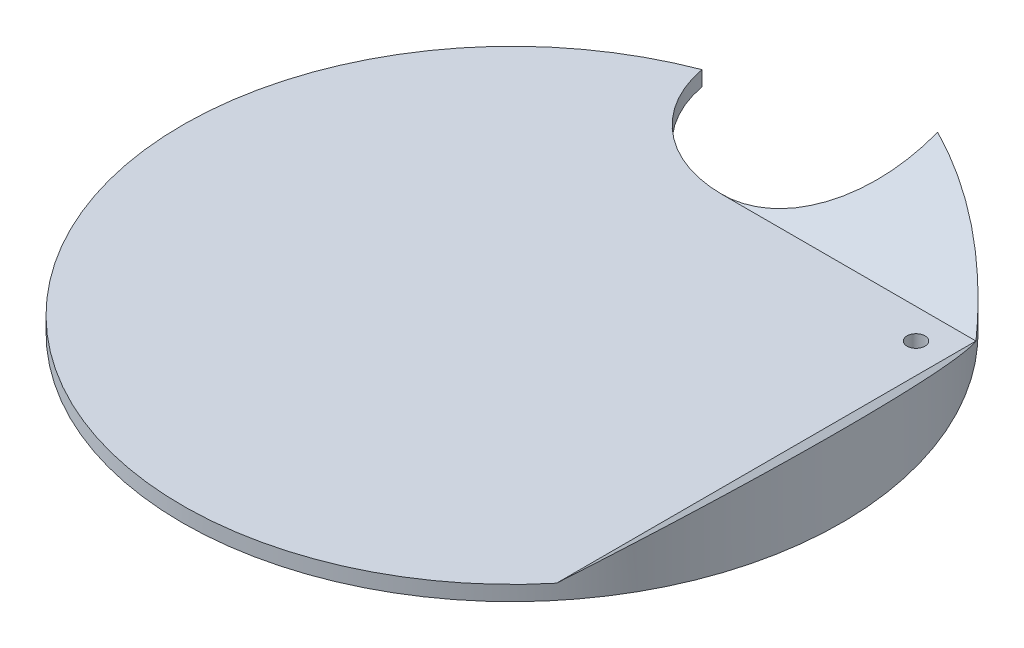
ISO-10303-21;
HEADER;
FILE_DESCRIPTION(('STEP AP214'),'2;1');
FILE_NAME('part.step','',(''),(''),'','','');
FILE_SCHEMA(('AUTOMOTIVE_DESIGN { 1 0 10303 214 1 1 1 1 }'));
ENDSEC;
DATA;
#1=APPLICATION_CONTEXT('core data for automotive mechanical design processes');
#2=APPLICATION_PROTOCOL_DEFINITION('international standard','automotive_design',2000,#1);
#3=PRODUCT_CONTEXT('',#1,'mechanical');
#4=PRODUCT('Part','Part','',(#3));
#5=PRODUCT_RELATED_PRODUCT_CATEGORY('part','',(#4));
#6=PRODUCT_DEFINITION_FORMATION('','',#4);
#7=PRODUCT_DEFINITION_CONTEXT('part definition',#1,'design');
#8=PRODUCT_DEFINITION('design','',#6,#7);
#9=PRODUCT_DEFINITION_SHAPE('','',#8);
#10=(LENGTH_UNIT() NAMED_UNIT(*) SI_UNIT(.MILLI.,.METRE.));
#11=(NAMED_UNIT(*) PLANE_ANGLE_UNIT() SI_UNIT($,.RADIAN.));
#12=(NAMED_UNIT(*) SI_UNIT($,.STERADIAN.) SOLID_ANGLE_UNIT());
#13=UNCERTAINTY_MEASURE_WITH_UNIT(LENGTH_MEASURE(1.E-05),#10,'distance_accuracy_value','');
#14=(GEOMETRIC_REPRESENTATION_CONTEXT(3) GLOBAL_UNCERTAINTY_ASSIGNED_CONTEXT((#13)) GLOBAL_UNIT_ASSIGNED_CONTEXT((#10,
#11,#12)) REPRESENTATION_CONTEXT('',''));
#15=CARTESIAN_POINT('',(0.,0.,0.));
#16=DIRECTION('',(0.,0.,1.));
#17=DIRECTION('',(1.,0.,0.));
#18=AXIS2_PLACEMENT_3D('',#15,#16,#17);
#19=CARTESIAN_POINT('',(0.,12.7,0.));
#20=DIRECTION('',(0.,1.,0.));
#21=DIRECTION('',(0.,0.,1.));
#22=AXIS2_PLACEMENT_3D('',#19,#20,#21);
#23=PLANE('',#22);
#24=CARTESIAN_POINT('',(190.12614690566,12.7,-152.4));
#25=DIRECTION('',(0.,1.,0.));
#26=DIRECTION('',(0.,0.,1.));
#27=AXIS2_PLACEMENT_3D('',#24,#25,#26);
#28=CIRCLE('',#27,7.62);
#29=CARTESIAN_POINT('',(190.12614690566,12.7,-144.78));
#30=VERTEX_POINT('',#29);
#31=EDGE_CURVE('E153',#30,#30,#28,.T.);
#32=ORIENTED_EDGE('',*,*,#31,.F.);
#33=EDGE_LOOP('',(#32));
#34=FACE_BOUND('',#33,.T.);
#35=DIRECTION('',(0.,0.,1.));
#36=VECTOR('',#35,1.);
#37=CARTESIAN_POINT('',(215.52614690566,12.7,0.));
#38=LINE('',#37,#36);
#39=CARTESIAN_POINT('',(215.52614690566,12.7,-177.8));
#40=VERTEX_POINT('',#39);
#41=CARTESIAN_POINT('',(215.52614690566,12.7,177.8));
#42=VERTEX_POINT('',#41);
#43=EDGE_CURVE('E105',#40,#42,#38,.T.);
#44=ORIENTED_EDGE('',*,*,#43,.F.);
#45=DIRECTION('',(1.,0.,0.));
#46=VECTOR('',#45,1.);
#47=CARTESIAN_POINT('',(0.,12.7,-177.8));
#48=LINE('',#47,#46);
#49=CARTESIAN_POINT('',(0.,12.7,-177.8));
#50=VERTEX_POINT('',#49);
#51=EDGE_CURVE('E95',#50,#40,#48,.T.);
#52=ORIENTED_EDGE('',*,*,#51,.F.);
#53=CARTESIAN_POINT('',(0.,12.7,-279.4));
#54=DIRECTION('',(0.,1.,0.));
#55=DIRECTION('',(0.,0.,1.));
#56=AXIS2_PLACEMENT_3D('',#53,#54,#55);
#57=CIRCLE('',#56,101.6);
#58=CARTESIAN_POINT('',(-99.9065480692203,12.7,-260.927272727273));
#59=VERTEX_POINT('',#58);
#60=EDGE_CURVE('E101',#59,#50,#57,.T.);
#61=ORIENTED_EDGE('',*,*,#60,.F.);
#62=CARTESIAN_POINT('',(0.,12.7,0.));
#63=DIRECTION('',(0.,1.,0.));
#64=DIRECTION('',(0.,0.,1.));
#65=AXIS2_PLACEMENT_3D('',#62,#63,#64);
#66=CIRCLE('',#65,279.4);
#67=EDGE_CURVE('E56',#59,#42,#66,.T.);
#68=ORIENTED_EDGE('',*,*,#67,.T.);
#69=EDGE_LOOP('',(#44,#52,#61,#68));
#70=FACE_BOUND('',#69,.T.);
#71=ADVANCED_FACE('F46',(#34,#70),#23,.T.);
#72=CARTESIAN_POINT('',(0.,12.7,0.));
#73=DIRECTION('',(0.,-1.,0.));
#74=DIRECTION('',(0.,0.,-1.));
#75=AXIS2_PLACEMENT_3D('',#72,#73,#74);
#76=CYLINDRICAL_SURFACE('',#75,279.4);
#77=CARTESIAN_POINT('',(0.,-102.764670070518,0.));
#78=DIRECTION('',(0.,-0.838670567945422,-0.544639035015031));
#79=DIRECTION('',(0.,-0.544639035015031,0.838670567945422));
#80=AXIS2_PLACEMENT_3D('',#77,#78,#79);
#81=ELLIPSE('',#80,333.146304018365,279.4);
#82=CARTESIAN_POINT('',(99.9065480692202,66.6834821108918,-260.927272727273));
#83=VERTEX_POINT('',#82);
#84=EDGE_CURVE('E86',#83,#40,#81,.T.);
#85=ORIENTED_EDGE('',*,*,#84,.T.);
#86=CARTESIAN_POINT('',(0.,-174.654021157724,0.));
#87=DIRECTION('',(-0.656059028990511,0.754709580222769,0.));
#88=DIRECTION('',(-0.754709580222769,-0.656059028990511,0.));
#89=AXIS2_PLACEMENT_3D('',#86,#87,#88);
#90=ELLIPSE('',#89,370.20863034166,279.4);
#91=EDGE_CURVE('E112',#42,#40,#90,.T.);
#92=ORIENTED_EDGE('',*,*,#91,.F.);
#93=ORIENTED_EDGE('',*,*,#67,.F.);
#94=DIRECTION('',(0.,1.,0.));
#95=VECTOR('',#94,1.);
#96=CARTESIAN_POINT('',(-99.9065480692204,6.35,-260.927272727273));
#97=LINE('',#96,#95);
#98=CARTESIAN_POINT('',(-99.9065480692203,0.,-260.927272727273));
#99=VERTEX_POINT('',#98);
#100=EDGE_CURVE('E92',#59,#99,#97,.F.);
#101=ORIENTED_EDGE('',*,*,#100,.T.);
#102=CARTESIAN_POINT('',(0.,0.,0.));
#103=DIRECTION('',(0.,1.,0.));
#104=DIRECTION('',(0.,0.,1.));
#105=AXIS2_PLACEMENT_3D('',#102,#103,#104);
#106=CIRCLE('',#105,279.4);
#107=CARTESIAN_POINT('',(99.9065480692202,0.,-260.927272727273));
#108=VERTEX_POINT('',#107);
#109=EDGE_CURVE('E90',#99,#108,#106,.T.);
#110=ORIENTED_EDGE('',*,*,#109,.T.);
#111=DIRECTION('',(0.,1.,0.));
#112=VECTOR('',#111,1.);
#113=CARTESIAN_POINT('',(99.9065480692204,6.35,-260.927272727273));
#114=LINE('',#113,#112);
#115=EDGE_CURVE('E70',#108,#83,#114,.T.);
#116=ORIENTED_EDGE('',*,*,#115,.T.);
#117=EDGE_LOOP('',(#85,#92,#93,#101,#110,#116));
#118=FACE_BOUND('',#117,.T.);
#119=ADVANCED_FACE('F48',(#118),#76,.T.);
#120=CARTESIAN_POINT('',(0.,0.,0.));
#121=DIRECTION('',(0.,1.,0.));
#122=DIRECTION('',(0.,0.,1.));
#123=AXIS2_PLACEMENT_3D('',#120,#121,#122);
#124=PLANE('',#123);
#125=CARTESIAN_POINT('',(190.12614690566,0.,-152.4));
#126=DIRECTION('',(0.,1.,0.));
#127=DIRECTION('',(0.,0.,1.));
#128=AXIS2_PLACEMENT_3D('',#125,#126,#127);
#129=CIRCLE('',#128,7.62);
#130=CARTESIAN_POINT('',(190.12614690566,0.,-144.78));
#131=VERTEX_POINT('',#130);
#132=EDGE_CURVE('E50',#131,#131,#129,.T.);
#133=ORIENTED_EDGE('',*,*,#132,.T.);
#134=EDGE_LOOP('',(#133));
#135=FACE_BOUND('',#134,.T.);
#136=ORIENTED_EDGE('',*,*,#109,.F.);
#137=CARTESIAN_POINT('',(0.,0.,-279.4));
#138=DIRECTION('',(0.,1.,0.));
#139=DIRECTION('',(0.,0.,1.));
#140=AXIS2_PLACEMENT_3D('',#137,#138,#139);
#141=CIRCLE('',#140,101.6);
#142=EDGE_CURVE('E11',#99,#108,#141,.T.);
#143=ORIENTED_EDGE('',*,*,#142,.T.);
#144=EDGE_LOOP('',(#136,#143));
#145=FACE_BOUND('',#144,.T.);
#146=ADVANCED_FACE('F135',(#135,#145),#124,.F.);
#147=CARTESIAN_POINT('',(0.,0.,-279.4));
#148=DIRECTION('',(0.,1.,0.));
#149=DIRECTION('',(0.,0.,1.));
#150=AXIS2_PLACEMENT_3D('',#147,#148,#149);
#151=CYLINDRICAL_SURFACE('',#150,101.6);
#152=ORIENTED_EDGE('',*,*,#60,.T.);
#153=CARTESIAN_POINT('',(0.,78.6798114688677,-279.4));
#154=DIRECTION('',(0.,-0.838670567945422,-0.544639035015031));
#155=DIRECTION('',(0.,-0.544639035015031,0.838670567945422));
#156=AXIS2_PLACEMENT_3D('',#153,#154,#155);
#157=ELLIPSE('',#156,121.144110552133,101.6);
#158=EDGE_CURVE('E63',#50,#83,#157,.F.);
#159=ORIENTED_EDGE('',*,*,#158,.T.);
#160=ORIENTED_EDGE('',*,*,#115,.F.);
#161=ORIENTED_EDGE('',*,*,#142,.F.);
#162=ORIENTED_EDGE('',*,*,#100,.F.);
#163=EDGE_LOOP('',(#152,#159,#160,#161,#162));
#164=FACE_BOUND('',#163,.T.);
#165=ADVANCED_FACE('F99',(#164),#151,.F.);
#166=CARTESIAN_POINT('',(86.4771501149043,-99.4805814386936,0.));
#167=DIRECTION('',(-0.656059028990511,0.754709580222769,0.));
#168=DIRECTION('',(-0.754709580222769,-0.656059028990511,0.));
#169=AXIS2_PLACEMENT_3D('',#166,#167,#168);
#170=PLANE('',#169);
#171=ORIENTED_EDGE('',*,*,#43,.T.);
#172=ORIENTED_EDGE('',*,*,#91,.T.);
#173=EDGE_LOOP('',(#171,#172));
#174=FACE_BOUND('',#173,.T.);
#175=ADVANCED_FACE('F126',(#174),#170,.T.);
#176=CARTESIAN_POINT('',(0.,-72.2814135008963,-46.9400987745315));
#177=DIRECTION('',(0.,-0.838670567945422,-0.544639035015031));
#178=DIRECTION('',(0.,0.544639035015031,-0.838670567945422));
#179=AXIS2_PLACEMENT_3D('',#176,#177,#178);
#180=PLANE('',#179);
#181=ORIENTED_EDGE('',*,*,#51,.T.);
#182=ORIENTED_EDGE('',*,*,#84,.F.);
#183=ORIENTED_EDGE('',*,*,#158,.F.);
#184=EDGE_LOOP('',(#181,#182,#183));
#185=FACE_BOUND('',#184,.T.);
#186=ADVANCED_FACE('F94',(#185),#180,.F.);
#187=CARTESIAN_POINT('',(190.12614690566,-80.264,-152.4));
#188=DIRECTION('',(0.,1.,0.));
#189=DIRECTION('',(0.,0.,1.));
#190=AXIS2_PLACEMENT_3D('',#187,#188,#189);
#191=CYLINDRICAL_SURFACE('',#190,7.62);
#192=ORIENTED_EDGE('',*,*,#31,.T.);
#193=EDGE_LOOP('',(#192));
#194=FACE_BOUND('',#193,.T.);
#195=ORIENTED_EDGE('',*,*,#132,.F.);
#196=EDGE_LOOP('',(#195));
#197=FACE_BOUND('',#196,.T.);
#198=ADVANCED_FACE('F133',(#194,#197),#191,.F.);
#199=CLOSED_SHELL('',(#71,#119,#146,#165,#175,#186,#198));
#200=MANIFOLD_SOLID_BREP('B2',#199);
#201=ADVANCED_BREP_SHAPE_REPRESENTATION('',(#18,#200),#14);
#202=SHAPE_DEFINITION_REPRESENTATION(#9,#201);
ENDSEC;
END-ISO-10303-21;
